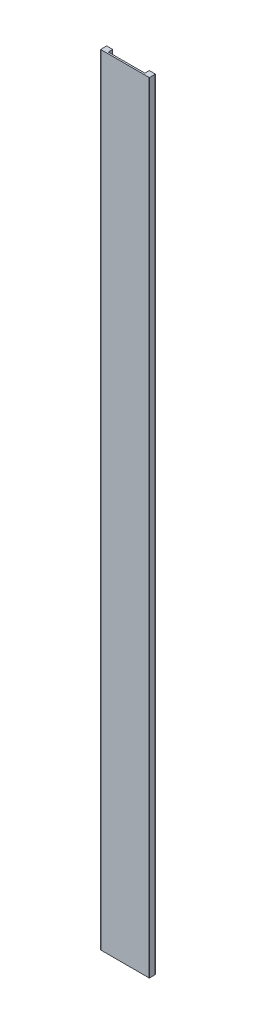
ISO-10303-21;
HEADER;
FILE_DESCRIPTION(('STEP AP214'),'2;1');
FILE_NAME('part.step','',(''),(''),'','','');
FILE_SCHEMA(('AUTOMOTIVE_DESIGN { 1 0 10303 214 1 1 1 1 }'));
ENDSEC;
DATA;
#1=APPLICATION_CONTEXT('core data for automotive mechanical design processes');
#2=APPLICATION_PROTOCOL_DEFINITION('international standard','automotive_design',2000,#1);
#3=PRODUCT_CONTEXT('',#1,'mechanical');
#4=PRODUCT('Part','Part','',(#3));
#5=PRODUCT_RELATED_PRODUCT_CATEGORY('part','',(#4));
#6=PRODUCT_DEFINITION_FORMATION('','',#4);
#7=PRODUCT_DEFINITION_CONTEXT('part definition',#1,'design');
#8=PRODUCT_DEFINITION('design','',#6,#7);
#9=PRODUCT_DEFINITION_SHAPE('','',#8);
#10=(LENGTH_UNIT() NAMED_UNIT(*) SI_UNIT(.MILLI.,.METRE.));
#11=(NAMED_UNIT(*) PLANE_ANGLE_UNIT() SI_UNIT($,.RADIAN.));
#12=(NAMED_UNIT(*) SI_UNIT($,.STERADIAN.) SOLID_ANGLE_UNIT());
#13=UNCERTAINTY_MEASURE_WITH_UNIT(LENGTH_MEASURE(1.E-05),#10,'distance_accuracy_value','');
#14=(GEOMETRIC_REPRESENTATION_CONTEXT(3) GLOBAL_UNCERTAINTY_ASSIGNED_CONTEXT((#13)) GLOBAL_UNIT_ASSIGNED_CONTEXT((#10,
#11,#12)) REPRESENTATION_CONTEXT('',''));
#15=CARTESIAN_POINT('',(0.,0.,0.));
#16=DIRECTION('',(0.,0.,1.));
#17=DIRECTION('',(1.,0.,0.));
#18=AXIS2_PLACEMENT_3D('',#15,#16,#17);
#19=CARTESIAN_POINT('',(38.1,1219.2,0.));
#20=DIRECTION('',(-1.,0.,0.));
#21=DIRECTION('',(0.,0.,1.));
#22=AXIS2_PLACEMENT_3D('',#19,#20,#21);
#23=PLANE('',#22);
#24=DIRECTION('',(0.,0.,-1.));
#25=VECTOR('',#24,1.);
#26=CARTESIAN_POINT('',(38.1,1219.2,0.));
#27=LINE('',#26,#25);
#28=CARTESIAN_POINT('',(38.1,1219.2,-0.381000000000028));
#29=VERTEX_POINT('',#28);
#30=CARTESIAN_POINT('',(38.1,1219.2,-9.14399999999999));
#31=VERTEX_POINT('',#30);
#32=EDGE_CURVE('E173',#29,#31,#27,.T.);
#33=ORIENTED_EDGE('',*,*,#32,.F.);
#34=DIRECTION('',(0.,-1.,0.));
#35=VECTOR('',#34,1.);
#36=CARTESIAN_POINT('',(38.1,1219.2,-0.381000000000028));
#37=LINE('',#36,#35);
#38=CARTESIAN_POINT('',(38.1,0.,-0.381000000000028));
#39=VERTEX_POINT('',#38);
#40=EDGE_CURVE('E218',#29,#39,#37,.T.);
#41=ORIENTED_EDGE('',*,*,#40,.T.);
#42=DIRECTION('',(0.,0.,-1.));
#43=VECTOR('',#42,1.);
#44=CARTESIAN_POINT('',(38.1,0.,0.));
#45=LINE('',#44,#43);
#46=CARTESIAN_POINT('',(38.1,0.,-9.14399999999999));
#47=VERTEX_POINT('',#46);
#48=EDGE_CURVE('E273',#39,#47,#45,.T.);
#49=ORIENTED_EDGE('',*,*,#48,.T.);
#50=DIRECTION('',(0.,-1.,0.));
#51=VECTOR('',#50,1.);
#52=CARTESIAN_POINT('',(38.1,1219.2,-9.14399999999999));
#53=LINE('',#52,#51);
#54=EDGE_CURVE('E216',#47,#31,#53,.F.);
#55=ORIENTED_EDGE('',*,*,#54,.T.);
#56=EDGE_LOOP('',(#33,#41,#49,#55));
#57=FACE_BOUND('',#56,.T.);
#58=ADVANCED_FACE('F33',(#57),#23,.F.);
#59=CARTESIAN_POINT('',(38.1,1219.2,-9.52499999999999));
#60=DIRECTION('',(0.,0.,1.));
#61=DIRECTION('',(1.,0.,0.));
#62=AXIS2_PLACEMENT_3D('',#59,#60,#61);
#63=PLANE('',#62);
#64=DIRECTION('',(-1.,0.,0.));
#65=VECTOR('',#64,1.);
#66=CARTESIAN_POINT('',(38.1,1219.2,-9.52499999999999));
#67=LINE('',#66,#65);
#68=CARTESIAN_POINT('',(37.719,1219.2,-9.52499999999998));
#69=VERTEX_POINT('',#68);
#70=CARTESIAN_POINT('',(28.956,1219.2,-9.52499999999997));
#71=VERTEX_POINT('',#70);
#72=EDGE_CURVE('E177',#69,#71,#67,.T.);
#73=ORIENTED_EDGE('',*,*,#72,.F.);
#74=DIRECTION('',(0.,-1.,0.));
#75=VECTOR('',#74,1.);
#76=CARTESIAN_POINT('',(37.719,1219.2,-9.52499999999998));
#77=LINE('',#76,#75);
#78=CARTESIAN_POINT('',(37.719,0.,-9.52499999999998));
#79=VERTEX_POINT('',#78);
#80=EDGE_CURVE('E223',#69,#79,#77,.T.);
#81=ORIENTED_EDGE('',*,*,#80,.T.);
#82=DIRECTION('',(-1.,0.,0.));
#83=VECTOR('',#82,1.);
#84=CARTESIAN_POINT('',(38.1,0.,-9.52499999999999));
#85=LINE('',#84,#83);
#86=CARTESIAN_POINT('',(28.956,0.,-9.52499999999997));
#87=VERTEX_POINT('',#86);
#88=EDGE_CURVE('E276',#79,#87,#85,.T.);
#89=ORIENTED_EDGE('',*,*,#88,.T.);
#90=DIRECTION('',(0.,-1.,0.));
#91=VECTOR('',#90,1.);
#92=CARTESIAN_POINT('',(28.956,1219.2,-9.52499999999997));
#93=LINE('',#92,#91);
#94=EDGE_CURVE('E221',#87,#71,#93,.F.);
#95=ORIENTED_EDGE('',*,*,#94,.T.);
#96=EDGE_LOOP('',(#73,#81,#89,#95));
#97=FACE_BOUND('',#96,.T.);
#98=ADVANCED_FACE('F300',(#97),#63,.F.);
#99=CARTESIAN_POINT('',(28.575,1219.2,-9.52499999999996));
#100=DIRECTION('',(1.,0.,0.));
#101=DIRECTION('',(0.,0.,-1.));
#102=AXIS2_PLACEMENT_3D('',#99,#100,#101);
#103=PLANE('',#102);
#104=DIRECTION('',(0.,0.,1.));
#105=VECTOR('',#104,1.);
#106=CARTESIAN_POINT('',(28.575,0.,-9.52499999999996));
#107=LINE('',#106,#105);
#108=CARTESIAN_POINT('',(28.575,0.,-9.14399999999997));
#109=VERTEX_POINT('',#108);
#110=CARTESIAN_POINT('',(28.575,0.,-2.92100000000003));
#111=VERTEX_POINT('',#110);
#112=EDGE_CURVE('E252',#109,#111,#107,.T.);
#113=ORIENTED_EDGE('',*,*,#112,.T.);
#114=DIRECTION('',(0.,-1.,0.));
#115=VECTOR('',#114,1.);
#116=CARTESIAN_POINT('',(28.575,1219.2,-2.92100000000003));
#117=LINE('',#116,#115);
#118=CARTESIAN_POINT('',(28.575,1219.2,-2.92100000000003));
#119=VERTEX_POINT('',#118);
#120=EDGE_CURVE('E214',#111,#119,#117,.F.);
#121=ORIENTED_EDGE('',*,*,#120,.T.);
#122=DIRECTION('',(0.,0.,1.));
#123=VECTOR('',#122,1.);
#124=CARTESIAN_POINT('',(28.575,1219.2,-9.52499999999996));
#125=LINE('',#124,#123);
#126=CARTESIAN_POINT('',(28.575,1219.2,-9.14399999999997));
#127=VERTEX_POINT('',#126);
#128=EDGE_CURVE('E267',#127,#119,#125,.T.);
#129=ORIENTED_EDGE('',*,*,#128,.F.);
#130=DIRECTION('',(0.,-1.,0.));
#131=VECTOR('',#130,1.);
#132=CARTESIAN_POINT('',(28.575,1219.2,-9.14399999999997));
#133=LINE('',#132,#131);
#134=EDGE_CURVE('E211',#127,#109,#133,.T.);
#135=ORIENTED_EDGE('',*,*,#134,.T.);
#136=EDGE_LOOP('',(#113,#121,#129,#135));
#137=FACE_BOUND('',#136,.T.);
#138=ADVANCED_FACE('F306',(#137),#103,.F.);
#139=CARTESIAN_POINT('',(28.575,1219.2,-2.54000000000003));
#140=DIRECTION('',(0.,0.,1.));
#141=DIRECTION('',(1.,0.,0.));
#142=AXIS2_PLACEMENT_3D('',#139,#140,#141);
#143=PLANE('',#142);
#144=DIRECTION('',(-1.,0.,0.));
#145=VECTOR('',#144,1.);
#146=CARTESIAN_POINT('',(28.575,1219.2,-2.54000000000003));
#147=LINE('',#146,#145);
#148=CARTESIAN_POINT('',(28.194,1219.2,-2.54000000000003));
#149=VERTEX_POINT('',#148);
#150=CARTESIAN_POINT('',(-28.194,1219.2,-2.53999999999999));
#151=VERTEX_POINT('',#150);
#152=EDGE_CURVE('E259',#149,#151,#147,.T.);
#153=ORIENTED_EDGE('',*,*,#152,.F.);
#154=DIRECTION('',(0.,-1.,0.));
#155=VECTOR('',#154,1.);
#156=CARTESIAN_POINT('',(28.194,0.,-2.54000000000003));
#157=LINE('',#156,#155);
#158=CARTESIAN_POINT('',(28.194,0.,-2.54000000000003));
#159=VERTEX_POINT('',#158);
#160=EDGE_CURVE('E208',#149,#159,#157,.T.);
#161=ORIENTED_EDGE('',*,*,#160,.T.);
#162=DIRECTION('',(-1.,0.,0.));
#163=VECTOR('',#162,1.);
#164=CARTESIAN_POINT('',(28.575,0.,-2.54000000000003));
#165=LINE('',#164,#163);
#166=CARTESIAN_POINT('',(-28.194,0.,-2.53999999999999));
#167=VERTEX_POINT('',#166);
#168=EDGE_CURVE('E241',#159,#167,#165,.T.);
#169=ORIENTED_EDGE('',*,*,#168,.T.);
#170=DIRECTION('',(0.,-1.,0.));
#171=VECTOR('',#170,1.);
#172=CARTESIAN_POINT('',(-28.194,1219.2,-2.53999999999999));
#173=LINE('',#172,#171);
#174=EDGE_CURVE('E206',#167,#151,#173,.F.);
#175=ORIENTED_EDGE('',*,*,#174,.T.);
#176=EDGE_LOOP('',(#153,#161,#169,#175));
#177=FACE_BOUND('',#176,.T.);
#178=ADVANCED_FACE('F249',(#177),#143,.F.);
#179=CARTESIAN_POINT('',(-28.575,1219.2,-9.52499999999996));
#180=DIRECTION('',(-1.,0.,0.));
#181=DIRECTION('',(0.,0.,1.));
#182=AXIS2_PLACEMENT_3D('',#179,#180,#181);
#183=PLANE('',#182);
#184=DIRECTION('',(0.,0.,-1.));
#185=VECTOR('',#184,1.);
#186=CARTESIAN_POINT('',(-28.575,0.,-9.52499999999996));
#187=LINE('',#186,#185);
#188=CARTESIAN_POINT('',(-28.575,0.,-2.92099999999999));
#189=VERTEX_POINT('',#188);
#190=CARTESIAN_POINT('',(-28.575,0.,-9.14399999999997));
#191=VERTEX_POINT('',#190);
#192=EDGE_CURVE('E243',#189,#191,#187,.T.);
#193=ORIENTED_EDGE('',*,*,#192,.T.);
#194=DIRECTION('',(0.,-1.,0.));
#195=VECTOR('',#194,1.);
#196=CARTESIAN_POINT('',(-28.575,1219.2,-9.14399999999997));
#197=LINE('',#196,#195);
#198=CARTESIAN_POINT('',(-28.575,1219.2,-9.14399999999997));
#199=VERTEX_POINT('',#198);
#200=EDGE_CURVE('E233',#191,#199,#197,.F.);
#201=ORIENTED_EDGE('',*,*,#200,.T.);
#202=DIRECTION('',(0.,0.,-1.));
#203=VECTOR('',#202,1.);
#204=CARTESIAN_POINT('',(-28.575,1219.2,-9.52499999999996));
#205=LINE('',#204,#203);
#206=CARTESIAN_POINT('',(-28.575,1219.2,-2.92099999999999));
#207=VERTEX_POINT('',#206);
#208=EDGE_CURVE('E258',#207,#199,#205,.T.);
#209=ORIENTED_EDGE('',*,*,#208,.F.);
#210=DIRECTION('',(0.,-1.,0.));
#211=VECTOR('',#210,1.);
#212=CARTESIAN_POINT('',(-28.575,0.,-2.92099999999999));
#213=LINE('',#212,#211);
#214=EDGE_CURVE('E230',#207,#189,#213,.T.);
#215=ORIENTED_EDGE('',*,*,#214,.T.);
#216=EDGE_LOOP('',(#193,#201,#209,#215));
#217=FACE_BOUND('',#216,.T.);
#218=ADVANCED_FACE('F261',(#217),#183,.F.);
#219=CARTESIAN_POINT('',(-38.1,1219.2,-9.52499999999999));
#220=DIRECTION('',(0.,0.,1.));
#221=DIRECTION('',(1.,0.,0.));
#222=AXIS2_PLACEMENT_3D('',#219,#220,#221);
#223=PLANE('',#222);
#224=DIRECTION('',(-1.,0.,0.));
#225=VECTOR('',#224,1.);
#226=CARTESIAN_POINT('',(-38.1,0.,-9.52499999999999));
#227=LINE('',#226,#225);
#228=CARTESIAN_POINT('',(-28.956,0.,-9.52499999999997));
#229=VERTEX_POINT('',#228);
#230=CARTESIAN_POINT('',(-37.719,0.,-9.52499999999998));
#231=VERTEX_POINT('',#230);
#232=EDGE_CURVE('E179',#229,#231,#227,.T.);
#233=ORIENTED_EDGE('',*,*,#232,.T.);
#234=DIRECTION('',(0.,-1.,0.));
#235=VECTOR('',#234,1.);
#236=CARTESIAN_POINT('',(-37.719,1219.2,-9.52499999999998));
#237=LINE('',#236,#235);
#238=CARTESIAN_POINT('',(-37.719,1219.2,-9.52499999999998));
#239=VERTEX_POINT('',#238);
#240=EDGE_CURVE('E48',#231,#239,#237,.F.);
#241=ORIENTED_EDGE('',*,*,#240,.T.);
#242=DIRECTION('',(-1.,0.,0.));
#243=VECTOR('',#242,1.);
#244=CARTESIAN_POINT('',(-38.1,1219.2,-9.52499999999999));
#245=LINE('',#244,#243);
#246=CARTESIAN_POINT('',(-28.956,1219.2,-9.52499999999997));
#247=VERTEX_POINT('',#246);
#248=EDGE_CURVE('E263',#247,#239,#245,.T.);
#249=ORIENTED_EDGE('',*,*,#248,.F.);
#250=DIRECTION('',(0.,-1.,0.));
#251=VECTOR('',#250,1.);
#252=CARTESIAN_POINT('',(-28.956,1219.2,-9.52499999999997));
#253=LINE('',#252,#251);
#254=EDGE_CURVE('E226',#247,#229,#253,.T.);
#255=ORIENTED_EDGE('',*,*,#254,.T.);
#256=EDGE_LOOP('',(#233,#241,#249,#255));
#257=FACE_BOUND('',#256,.T.);
#258=ADVANCED_FACE('F282',(#257),#223,.F.);
#259=CARTESIAN_POINT('',(-38.1,1219.2,0.));
#260=DIRECTION('',(1.,0.,0.));
#261=DIRECTION('',(0.,0.,-1.));
#262=AXIS2_PLACEMENT_3D('',#259,#260,#261);
#263=PLANE('',#262);
#264=DIRECTION('',(0.,0.,1.));
#265=VECTOR('',#264,1.);
#266=CARTESIAN_POINT('',(-38.1,0.,0.));
#267=LINE('',#266,#265);
#268=CARTESIAN_POINT('',(-38.1,0.,-9.14399999999999));
#269=VERTEX_POINT('',#268);
#270=CARTESIAN_POINT('',(-38.1,0.,-0.381));
#271=VERTEX_POINT('',#270);
#272=EDGE_CURVE('E174',#269,#271,#267,.T.);
#273=ORIENTED_EDGE('',*,*,#272,.T.);
#274=DIRECTION('',(0.,-1.,0.));
#275=VECTOR('',#274,1.);
#276=CARTESIAN_POINT('',(-38.1,1219.2,-0.381));
#277=LINE('',#276,#275);
#278=CARTESIAN_POINT('',(-38.1,1219.2,-0.381));
#279=VERTEX_POINT('',#278);
#280=EDGE_CURVE('E152',#271,#279,#277,.F.);
#281=ORIENTED_EDGE('',*,*,#280,.T.);
#282=DIRECTION('',(0.,0.,1.));
#283=VECTOR('',#282,1.);
#284=CARTESIAN_POINT('',(-38.1,1219.2,0.));
#285=LINE('',#284,#283);
#286=CARTESIAN_POINT('',(-38.1,1219.2,-9.14399999999999));
#287=VERTEX_POINT('',#286);
#288=EDGE_CURVE('E265',#287,#279,#285,.T.);
#289=ORIENTED_EDGE('',*,*,#288,.F.);
#290=DIRECTION('',(0.,-1.,0.));
#291=VECTOR('',#290,1.);
#292=CARTESIAN_POINT('',(-38.1,1219.2,-9.14399999999999));
#293=LINE('',#292,#291);
#294=EDGE_CURVE('E157',#287,#269,#293,.T.);
#295=ORIENTED_EDGE('',*,*,#294,.T.);
#296=EDGE_LOOP('',(#273,#281,#289,#295));
#297=FACE_BOUND('',#296,.T.);
#298=ADVANCED_FACE('F290',(#297),#263,.F.);
#299=CARTESIAN_POINT('',(-38.1,1219.2,0.));
#300=DIRECTION('',(0.,0.,-1.));
#301=DIRECTION('',(-1.,0.,0.));
#302=AXIS2_PLACEMENT_3D('',#299,#300,#301);
#303=PLANE('',#302);
#304=DIRECTION('',(1.,0.,0.));
#305=VECTOR('',#304,1.);
#306=CARTESIAN_POINT('',(-38.1,1219.2,0.));
#307=LINE('',#306,#305);
#308=CARTESIAN_POINT('',(-37.719,1219.2,0.));
#309=VERTEX_POINT('',#308);
#310=CARTESIAN_POINT('',(37.719,1219.2,0.));
#311=VERTEX_POINT('',#310);
#312=EDGE_CURVE('E167',#309,#311,#307,.T.);
#313=ORIENTED_EDGE('',*,*,#312,.F.);
#314=DIRECTION('',(0.,-1.,0.));
#315=VECTOR('',#314,1.);
#316=CARTESIAN_POINT('',(-37.719,1219.2,0.));
#317=LINE('',#316,#315);
#318=CARTESIAN_POINT('',(-37.719,0.,0.));
#319=VERTEX_POINT('',#318);
#320=EDGE_CURVE('E151',#309,#319,#317,.T.);
#321=ORIENTED_EDGE('',*,*,#320,.T.);
#322=DIRECTION('',(1.,0.,0.));
#323=VECTOR('',#322,1.);
#324=CARTESIAN_POINT('',(-38.1,0.,0.));
#325=LINE('',#324,#323);
#326=CARTESIAN_POINT('',(37.719,0.,0.));
#327=VERTEX_POINT('',#326);
#328=EDGE_CURVE('E164',#319,#327,#325,.T.);
#329=ORIENTED_EDGE('',*,*,#328,.T.);
#330=DIRECTION('',(0.,-1.,0.));
#331=VECTOR('',#330,1.);
#332=CARTESIAN_POINT('',(37.719,1219.2,0.));
#333=LINE('',#332,#331);
#334=EDGE_CURVE('E169',#327,#311,#333,.F.);
#335=ORIENTED_EDGE('',*,*,#334,.T.);
#336=EDGE_LOOP('',(#313,#321,#329,#335));
#337=FACE_BOUND('',#336,.T.);
#338=ADVANCED_FACE('F163',(#337),#303,.F.);
#339=CARTESIAN_POINT('',(0.,1219.2,0.));
#340=DIRECTION('',(0.,1.,0.));
#341=DIRECTION('',(0.,0.,1.));
#342=AXIS2_PLACEMENT_3D('',#339,#340,#341);
#343=PLANE('',#342);
#344=ORIENTED_EDGE('',*,*,#288,.T.);
#345=CARTESIAN_POINT('',(-37.719,1219.2,-0.381));
#346=DIRECTION('',(0.,1.,0.));
#347=DIRECTION('',(0.,0.,1.));
#348=AXIS2_PLACEMENT_3D('',#345,#346,#347);
#349=CIRCLE('',#348,0.381);
#350=EDGE_CURVE('E204',#279,#309,#349,.T.);
#351=ORIENTED_EDGE('',*,*,#350,.T.);
#352=ORIENTED_EDGE('',*,*,#312,.T.);
#353=CARTESIAN_POINT('',(37.719,1219.2,-0.381000000000028));
#354=DIRECTION('',(0.,1.,0.));
#355=DIRECTION('',(0.,0.,1.));
#356=AXIS2_PLACEMENT_3D('',#353,#354,#355);
#357=CIRCLE('',#356,0.381);
#358=EDGE_CURVE('E202',#311,#29,#357,.T.);
#359=ORIENTED_EDGE('',*,*,#358,.T.);
#360=ORIENTED_EDGE('',*,*,#32,.T.);
#361=CARTESIAN_POINT('',(37.719,1219.2,-9.14399999999999));
#362=DIRECTION('',(0.,1.,0.));
#363=DIRECTION('',(0.,0.,1.));
#364=AXIS2_PLACEMENT_3D('',#361,#362,#363);
#365=CIRCLE('',#364,0.381);
#366=EDGE_CURVE('E200',#31,#69,#365,.T.);
#367=ORIENTED_EDGE('',*,*,#366,.T.);
#368=ORIENTED_EDGE('',*,*,#72,.T.);
#369=CARTESIAN_POINT('',(28.956,1219.2,-9.14399999999997));
#370=DIRECTION('',(0.,1.,0.));
#371=DIRECTION('',(0.,0.,1.));
#372=AXIS2_PLACEMENT_3D('',#369,#370,#371);
#373=CIRCLE('',#372,0.381);
#374=EDGE_CURVE('E198',#71,#127,#373,.T.);
#375=ORIENTED_EDGE('',*,*,#374,.T.);
#376=ORIENTED_EDGE('',*,*,#128,.T.);
#377=CARTESIAN_POINT('',(28.194,1219.2,-2.92100000000003));
#378=DIRECTION('',(0.,1.,0.));
#379=DIRECTION('',(0.,0.,1.));
#380=AXIS2_PLACEMENT_3D('',#377,#378,#379);
#381=CIRCLE('',#380,0.381);
#382=EDGE_CURVE('E237',#119,#149,#381,.F.);
#383=ORIENTED_EDGE('',*,*,#382,.T.);
#384=ORIENTED_EDGE('',*,*,#152,.T.);
#385=CARTESIAN_POINT('',(-28.194,1219.2,-2.92099999999999));
#386=DIRECTION('',(0.,1.,0.));
#387=DIRECTION('',(0.,0.,1.));
#388=AXIS2_PLACEMENT_3D('',#385,#386,#387);
#389=CIRCLE('',#388,0.381);
#390=EDGE_CURVE('E11',#151,#207,#389,.F.);
#391=ORIENTED_EDGE('',*,*,#390,.T.);
#392=ORIENTED_EDGE('',*,*,#208,.T.);
#393=CARTESIAN_POINT('',(-28.956,1219.2,-9.14399999999997));
#394=DIRECTION('',(0.,1.,0.));
#395=DIRECTION('',(0.,0.,1.));
#396=AXIS2_PLACEMENT_3D('',#393,#394,#395);
#397=CIRCLE('',#396,0.381);
#398=EDGE_CURVE('E55',#199,#247,#397,.T.);
#399=ORIENTED_EDGE('',*,*,#398,.T.);
#400=ORIENTED_EDGE('',*,*,#248,.T.);
#401=CARTESIAN_POINT('',(-37.719,1219.2,-9.14399999999999));
#402=DIRECTION('',(0.,1.,0.));
#403=DIRECTION('',(0.,0.,1.));
#404=AXIS2_PLACEMENT_3D('',#401,#402,#403);
#405=CIRCLE('',#404,0.381);
#406=EDGE_CURVE('E196',#239,#287,#405,.T.);
#407=ORIENTED_EDGE('',*,*,#406,.T.);
#408=EDGE_LOOP('',(#344,#351,#352,#359,#360,#367,#368,#375,#376,#383,#384,#391,#392,#399,#400,#407));
#409=FACE_BOUND('',#408,.T.);
#410=ADVANCED_FACE('F257',(#409),#343,.T.);
#411=CARTESIAN_POINT('',(0.,0.,0.));
#412=DIRECTION('',(0.,1.,0.));
#413=DIRECTION('',(0.,0.,1.));
#414=AXIS2_PLACEMENT_3D('',#411,#412,#413);
#415=PLANE('',#414);
#416=ORIENTED_EDGE('',*,*,#328,.F.);
#417=CARTESIAN_POINT('',(-37.719,0.,-0.381));
#418=DIRECTION('',(0.,1.,0.));
#419=DIRECTION('',(0.,0.,1.));
#420=AXIS2_PLACEMENT_3D('',#417,#418,#419);
#421=CIRCLE('',#420,0.381);
#422=EDGE_CURVE('E147',#319,#271,#421,.F.);
#423=ORIENTED_EDGE('',*,*,#422,.T.);
#424=ORIENTED_EDGE('',*,*,#272,.F.);
#425=CARTESIAN_POINT('',(-37.719,0.,-9.14399999999999));
#426=DIRECTION('',(0.,1.,0.));
#427=DIRECTION('',(0.,0.,1.));
#428=AXIS2_PLACEMENT_3D('',#425,#426,#427);
#429=CIRCLE('',#428,0.381);
#430=EDGE_CURVE('E185',#269,#231,#429,.F.);
#431=ORIENTED_EDGE('',*,*,#430,.T.);
#432=ORIENTED_EDGE('',*,*,#232,.F.);
#433=CARTESIAN_POINT('',(-28.956,0.,-9.14399999999997));
#434=DIRECTION('',(0.,1.,0.));
#435=DIRECTION('',(0.,0.,1.));
#436=AXIS2_PLACEMENT_3D('',#433,#434,#435);
#437=CIRCLE('',#436,0.381);
#438=EDGE_CURVE('E168',#229,#191,#437,.F.);
#439=ORIENTED_EDGE('',*,*,#438,.T.);
#440=ORIENTED_EDGE('',*,*,#192,.F.);
#441=CARTESIAN_POINT('',(-28.194,0.,-2.92099999999999));
#442=DIRECTION('',(0.,1.,0.));
#443=DIRECTION('',(0.,0.,1.));
#444=AXIS2_PLACEMENT_3D('',#441,#442,#443);
#445=CIRCLE('',#444,0.381);
#446=EDGE_CURVE('E41',#189,#167,#445,.T.);
#447=ORIENTED_EDGE('',*,*,#446,.T.);
#448=ORIENTED_EDGE('',*,*,#168,.F.);
#449=CARTESIAN_POINT('',(28.194,0.,-2.92100000000003));
#450=DIRECTION('',(0.,1.,0.));
#451=DIRECTION('',(0.,0.,1.));
#452=AXIS2_PLACEMENT_3D('',#449,#450,#451);
#453=CIRCLE('',#452,0.381);
#454=EDGE_CURVE('E235',#159,#111,#453,.T.);
#455=ORIENTED_EDGE('',*,*,#454,.T.);
#456=ORIENTED_EDGE('',*,*,#112,.F.);
#457=CARTESIAN_POINT('',(28.956,0.,-9.14399999999997));
#458=DIRECTION('',(0.,1.,0.));
#459=DIRECTION('',(0.,0.,1.));
#460=AXIS2_PLACEMENT_3D('',#457,#458,#459);
#461=CIRCLE('',#460,0.381);
#462=EDGE_CURVE('E187',#109,#87,#461,.F.);
#463=ORIENTED_EDGE('',*,*,#462,.T.);
#464=ORIENTED_EDGE('',*,*,#88,.F.);
#465=CARTESIAN_POINT('',(37.719,0.,-9.14399999999999));
#466=DIRECTION('',(0.,1.,0.));
#467=DIRECTION('',(0.,0.,1.));
#468=AXIS2_PLACEMENT_3D('',#465,#466,#467);
#469=CIRCLE('',#468,0.381);
#470=EDGE_CURVE('E189',#79,#47,#469,.F.);
#471=ORIENTED_EDGE('',*,*,#470,.T.);
#472=ORIENTED_EDGE('',*,*,#48,.F.);
#473=CARTESIAN_POINT('',(37.719,0.,-0.381000000000028));
#474=DIRECTION('',(0.,1.,0.));
#475=DIRECTION('',(0.,0.,1.));
#476=AXIS2_PLACEMENT_3D('',#473,#474,#475);
#477=CIRCLE('',#476,0.381);
#478=EDGE_CURVE('E158',#39,#327,#477,.F.);
#479=ORIENTED_EDGE('',*,*,#478,.T.);
#480=EDGE_LOOP('',(#416,#423,#424,#431,#432,#439,#440,#447,#448,#455,#456,#463,#464,#471,#472,#479));
#481=FACE_BOUND('',#480,.T.);
#482=ADVANCED_FACE('F171',(#481),#415,.F.);
#483=CARTESIAN_POINT('',(-37.719,1219.2,-0.381));
#484=DIRECTION('',(0.,-1.,0.));
#485=DIRECTION('',(0.,0.,-1.));
#486=AXIS2_PLACEMENT_3D('',#483,#484,#485);
#487=CYLINDRICAL_SURFACE('',#486,0.381);
#488=ORIENTED_EDGE('',*,*,#350,.F.);
#489=ORIENTED_EDGE('',*,*,#280,.F.);
#490=ORIENTED_EDGE('',*,*,#422,.F.);
#491=ORIENTED_EDGE('',*,*,#320,.F.);
#492=EDGE_LOOP('',(#488,#489,#490,#491));
#493=FACE_BOUND('',#492,.T.);
#494=ADVANCED_FACE('F150',(#493),#487,.T.);
#495=CARTESIAN_POINT('',(28.194,1219.2,-2.92100000000003));
#496=DIRECTION('',(0.,1.,0.));
#497=DIRECTION('',(0.,0.,1.));
#498=AXIS2_PLACEMENT_3D('',#495,#496,#497);
#499=CYLINDRICAL_SURFACE('',#498,0.381);
#500=ORIENTED_EDGE('',*,*,#382,.F.);
#501=ORIENTED_EDGE('',*,*,#120,.F.);
#502=ORIENTED_EDGE('',*,*,#454,.F.);
#503=ORIENTED_EDGE('',*,*,#160,.F.);
#504=EDGE_LOOP('',(#500,#501,#502,#503));
#505=FACE_BOUND('',#504,.T.);
#506=ADVANCED_FACE('F314',(#505),#499,.F.);
#507=CARTESIAN_POINT('',(37.719,1219.2,-0.381000000000028));
#508=DIRECTION('',(0.,-1.,0.));
#509=DIRECTION('',(0.,0.,-1.));
#510=AXIS2_PLACEMENT_3D('',#507,#508,#509);
#511=CYLINDRICAL_SURFACE('',#510,0.381);
#512=ORIENTED_EDGE('',*,*,#358,.F.);
#513=ORIENTED_EDGE('',*,*,#334,.F.);
#514=ORIENTED_EDGE('',*,*,#478,.F.);
#515=ORIENTED_EDGE('',*,*,#40,.F.);
#516=EDGE_LOOP('',(#512,#513,#514,#515));
#517=FACE_BOUND('',#516,.T.);
#518=ADVANCED_FACE('F317',(#517),#511,.T.);
#519=CARTESIAN_POINT('',(37.719,1219.2,-9.14399999999999));
#520=DIRECTION('',(0.,-1.,0.));
#521=DIRECTION('',(0.,0.,-1.));
#522=AXIS2_PLACEMENT_3D('',#519,#520,#521);
#523=CYLINDRICAL_SURFACE('',#522,0.381);
#524=ORIENTED_EDGE('',*,*,#366,.F.);
#525=ORIENTED_EDGE('',*,*,#54,.F.);
#526=ORIENTED_EDGE('',*,*,#470,.F.);
#527=ORIENTED_EDGE('',*,*,#80,.F.);
#528=EDGE_LOOP('',(#524,#525,#526,#527));
#529=FACE_BOUND('',#528,.T.);
#530=ADVANCED_FACE('F321',(#529),#523,.T.);
#531=CARTESIAN_POINT('',(28.956,1219.2,-9.14399999999997));
#532=DIRECTION('',(0.,-1.,0.));
#533=DIRECTION('',(0.,0.,-1.));
#534=AXIS2_PLACEMENT_3D('',#531,#532,#533);
#535=CYLINDRICAL_SURFACE('',#534,0.381);
#536=ORIENTED_EDGE('',*,*,#374,.F.);
#537=ORIENTED_EDGE('',*,*,#94,.F.);
#538=ORIENTED_EDGE('',*,*,#462,.F.);
#539=ORIENTED_EDGE('',*,*,#134,.F.);
#540=EDGE_LOOP('',(#536,#537,#538,#539));
#541=FACE_BOUND('',#540,.T.);
#542=ADVANCED_FACE('F325',(#541),#535,.T.);
#543=CARTESIAN_POINT('',(-37.719,1219.2,-9.14399999999999));
#544=DIRECTION('',(0.,-1.,0.));
#545=DIRECTION('',(0.,0.,-1.));
#546=AXIS2_PLACEMENT_3D('',#543,#544,#545);
#547=CYLINDRICAL_SURFACE('',#546,0.381);
#548=ORIENTED_EDGE('',*,*,#406,.F.);
#549=ORIENTED_EDGE('',*,*,#240,.F.);
#550=ORIENTED_EDGE('',*,*,#430,.F.);
#551=ORIENTED_EDGE('',*,*,#294,.F.);
#552=EDGE_LOOP('',(#548,#549,#550,#551));
#553=FACE_BOUND('',#552,.T.);
#554=ADVANCED_FACE('F286',(#553),#547,.T.);
#555=CARTESIAN_POINT('',(-28.956,1219.2,-9.14399999999997));
#556=DIRECTION('',(0.,-1.,0.));
#557=DIRECTION('',(0.,0.,-1.));
#558=AXIS2_PLACEMENT_3D('',#555,#556,#557);
#559=CYLINDRICAL_SURFACE('',#558,0.381);
#560=ORIENTED_EDGE('',*,*,#398,.F.);
#561=ORIENTED_EDGE('',*,*,#200,.F.);
#562=ORIENTED_EDGE('',*,*,#438,.F.);
#563=ORIENTED_EDGE('',*,*,#254,.F.);
#564=EDGE_LOOP('',(#560,#561,#562,#563));
#565=FACE_BOUND('',#564,.T.);
#566=ADVANCED_FACE('F331',(#565),#559,.T.);
#567=CARTESIAN_POINT('',(-28.194,1219.2,-2.92099999999999));
#568=DIRECTION('',(0.,1.,0.));
#569=DIRECTION('',(0.,0.,1.));
#570=AXIS2_PLACEMENT_3D('',#567,#568,#569);
#571=CYLINDRICAL_SURFACE('',#570,0.381);
#572=ORIENTED_EDGE('',*,*,#390,.F.);
#573=ORIENTED_EDGE('',*,*,#174,.F.);
#574=ORIENTED_EDGE('',*,*,#446,.F.);
#575=ORIENTED_EDGE('',*,*,#214,.F.);
#576=EDGE_LOOP('',(#572,#573,#574,#575));
#577=FACE_BOUND('',#576,.T.);
#578=ADVANCED_FACE('F35',(#577),#571,.F.);
#579=CLOSED_SHELL('',(#58,#98,#138,#178,#218,#258,#298,#338,#410,#482,#494,#506,#518,#530,#542,
#554,#566,#578));
#580=MANIFOLD_SOLID_BREP('B2',#579);
#581=ADVANCED_BREP_SHAPE_REPRESENTATION('',(#18,#580),#14);
#582=SHAPE_DEFINITION_REPRESENTATION(#9,#581);
ENDSEC;
END-ISO-10303-21;
